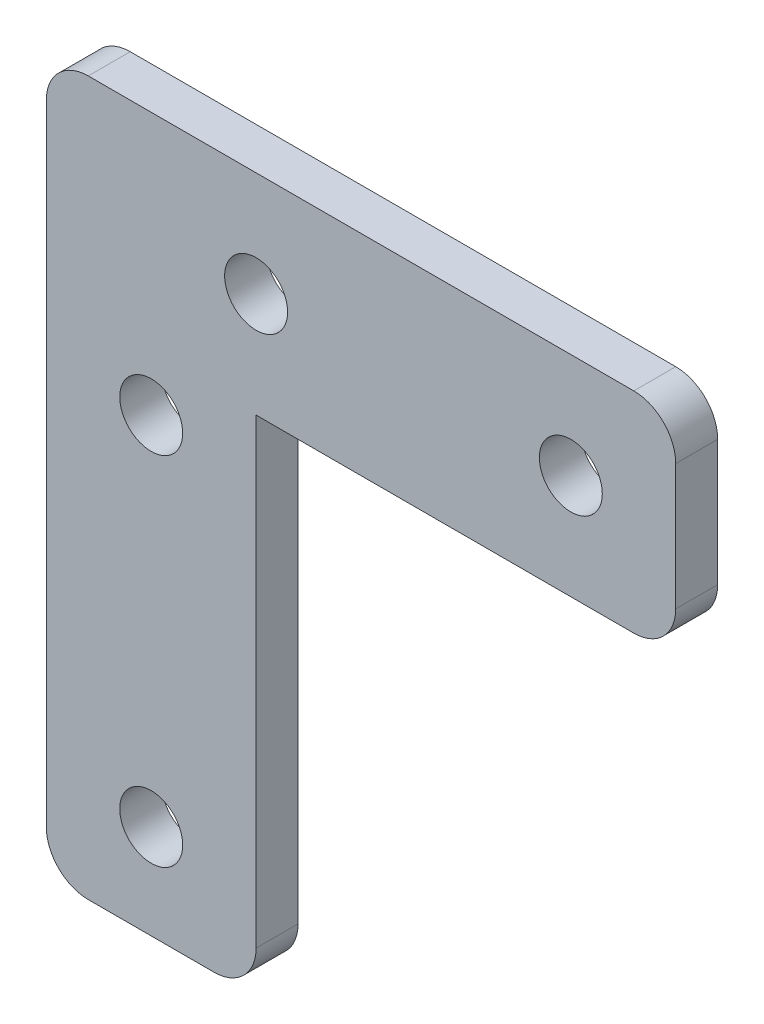
ISO-10303-21;
HEADER;
FILE_DESCRIPTION(('STEP AP214'),'2;1');
FILE_NAME('part.step','',(''),(''),'','','');
FILE_SCHEMA(('AUTOMOTIVE_DESIGN { 1 0 10303 214 1 1 1 1 }'));
ENDSEC;
DATA;
#1=APPLICATION_CONTEXT('core data for automotive mechanical design processes');
#2=APPLICATION_PROTOCOL_DEFINITION('international standard','automotive_design',2000,#1);
#3=PRODUCT_CONTEXT('',#1,'mechanical');
#4=PRODUCT('Part','Part','',(#3));
#5=PRODUCT_RELATED_PRODUCT_CATEGORY('part','',(#4));
#6=PRODUCT_DEFINITION_FORMATION('','',#4);
#7=PRODUCT_DEFINITION_CONTEXT('part definition',#1,'design');
#8=PRODUCT_DEFINITION('design','',#6,#7);
#9=PRODUCT_DEFINITION_SHAPE('','',#8);
#10=(LENGTH_UNIT() NAMED_UNIT(*) SI_UNIT(.MILLI.,.METRE.));
#11=(NAMED_UNIT(*) PLANE_ANGLE_UNIT() SI_UNIT($,.RADIAN.));
#12=(NAMED_UNIT(*) SI_UNIT($,.STERADIAN.) SOLID_ANGLE_UNIT());
#13=UNCERTAINTY_MEASURE_WITH_UNIT(LENGTH_MEASURE(1.E-05),#10,'distance_accuracy_value','');
#14=(GEOMETRIC_REPRESENTATION_CONTEXT(3) GLOBAL_UNCERTAINTY_ASSIGNED_CONTEXT((#13)) GLOBAL_UNIT_ASSIGNED_CONTEXT((#10,
#11,#12)) REPRESENTATION_CONTEXT('',''));
#15=CARTESIAN_POINT('',(0.,0.,0.));
#16=DIRECTION('',(0.,0.,1.));
#17=DIRECTION('',(1.,0.,0.));
#18=AXIS2_PLACEMENT_3D('',#15,#16,#17);
#19=CARTESIAN_POINT('',(0.,0.,2.));
#20=DIRECTION('',(0.,0.,1.));
#21=DIRECTION('',(1.,0.,0.));
#22=AXIS2_PLACEMENT_3D('',#19,#20,#21);
#23=PLANE('',#22);
#24=CARTESIAN_POINT('',(5.00000000000001,17.,2.));
#25=DIRECTION('',(0.,0.,1.));
#26=DIRECTION('',(1.,0.,0.));
#27=AXIS2_PLACEMENT_3D('',#24,#25,#26);
#28=CIRCLE('',#27,1.5);
#29=CARTESIAN_POINT('',(6.50000000000001,17.,2.));
#30=VERTEX_POINT('',#29);
#31=EDGE_CURVE('E266',#30,#30,#28,.T.);
#32=ORIENTED_EDGE('',*,*,#31,.F.);
#33=EDGE_LOOP('',(#32));
#34=FACE_BOUND('',#33,.T.);
#35=CARTESIAN_POINT('',(0.,9.49999999999999,2.));
#36=DIRECTION('',(0.,0.,1.));
#37=DIRECTION('',(1.,0.,0.));
#38=AXIS2_PLACEMENT_3D('',#35,#36,#37);
#39=CIRCLE('',#38,1.5);
#40=CARTESIAN_POINT('',(1.5,9.49999999999999,2.));
#41=VERTEX_POINT('',#40);
#42=EDGE_CURVE('E245',#41,#41,#39,.T.);
#43=ORIENTED_EDGE('',*,*,#42,.F.);
#44=EDGE_LOOP('',(#43));
#45=FACE_BOUND('',#44,.T.);
#46=DIRECTION('',(1.,0.,0.));
#47=VECTOR('',#46,1.);
#48=CARTESIAN_POINT('',(5.00000000000001,12.,2.));
#49=LINE('',#48,#47);
#50=CARTESIAN_POINT('',(5.00000000000001,12.,2.));
#51=VERTEX_POINT('',#50);
#52=CARTESIAN_POINT('',(23.,12.,2.));
#53=VERTEX_POINT('',#52);
#54=EDGE_CURVE('E126',#51,#53,#49,.T.);
#55=ORIENTED_EDGE('',*,*,#54,.T.);
#56=CARTESIAN_POINT('',(23.,14.,2.));
#57=DIRECTION('',(0.,0.,1.));
#58=DIRECTION('',(1.,0.,0.));
#59=AXIS2_PLACEMENT_3D('',#56,#57,#58);
#60=CIRCLE('',#59,2.);
#61=CARTESIAN_POINT('',(25.,14.,2.));
#62=VERTEX_POINT('',#61);
#63=EDGE_CURVE('E194',#53,#62,#60,.T.);
#64=ORIENTED_EDGE('',*,*,#63,.T.);
#65=DIRECTION('',(0.,1.,0.));
#66=VECTOR('',#65,1.);
#67=CARTESIAN_POINT('',(25.,12.,2.));
#68=LINE('',#67,#66);
#69=CARTESIAN_POINT('',(25.,20.,2.));
#70=VERTEX_POINT('',#69);
#71=EDGE_CURVE('E145',#62,#70,#68,.T.);
#72=ORIENTED_EDGE('',*,*,#71,.T.);
#73=CARTESIAN_POINT('',(23.,20.,2.));
#74=DIRECTION('',(0.,0.,1.));
#75=DIRECTION('',(1.,0.,0.));
#76=AXIS2_PLACEMENT_3D('',#73,#74,#75);
#77=CIRCLE('',#76,2.);
#78=CARTESIAN_POINT('',(23.,22.,2.));
#79=VERTEX_POINT('',#78);
#80=EDGE_CURVE('E184',#70,#79,#77,.T.);
#81=ORIENTED_EDGE('',*,*,#80,.T.);
#82=DIRECTION('',(-1.,0.,0.));
#83=VECTOR('',#82,1.);
#84=CARTESIAN_POINT('',(25.,22.,2.));
#85=LINE('',#84,#83);
#86=CARTESIAN_POINT('',(-2.99999999999999,22.,2.));
#87=VERTEX_POINT('',#86);
#88=EDGE_CURVE('E223',#79,#87,#85,.T.);
#89=ORIENTED_EDGE('',*,*,#88,.T.);
#90=CARTESIAN_POINT('',(-2.99999999999999,20.,2.));
#91=DIRECTION('',(0.,0.,1.));
#92=DIRECTION('',(1.,0.,0.));
#93=AXIS2_PLACEMENT_3D('',#90,#91,#92);
#94=CIRCLE('',#93,2.);
#95=CARTESIAN_POINT('',(-4.99999999999999,20.,2.));
#96=VERTEX_POINT('',#95);
#97=EDGE_CURVE('E187',#87,#96,#94,.T.);
#98=ORIENTED_EDGE('',*,*,#97,.T.);
#99=DIRECTION('',(0.,-1.,0.));
#100=VECTOR('',#99,1.);
#101=CARTESIAN_POINT('',(-4.99999999999999,22.,2.));
#102=LINE('',#101,#100);
#103=CARTESIAN_POINT('',(-4.99999999999999,-10.,2.));
#104=VERTEX_POINT('',#103);
#105=EDGE_CURVE('E159',#96,#104,#102,.T.);
#106=ORIENTED_EDGE('',*,*,#105,.T.);
#107=CARTESIAN_POINT('',(-3.00000000000001,-10.,2.));
#108=DIRECTION('',(0.,0.,1.));
#109=DIRECTION('',(1.,0.,0.));
#110=AXIS2_PLACEMENT_3D('',#107,#108,#109);
#111=CIRCLE('',#110,2.);
#112=CARTESIAN_POINT('',(-3.00000000000001,-12.,2.));
#113=VERTEX_POINT('',#112);
#114=EDGE_CURVE('E62',#104,#113,#111,.T.);
#115=ORIENTED_EDGE('',*,*,#114,.T.);
#116=DIRECTION('',(1.,0.,0.));
#117=VECTOR('',#116,1.);
#118=CARTESIAN_POINT('',(-5.00000000000001,-12.,2.));
#119=LINE('',#118,#117);
#120=CARTESIAN_POINT('',(3.00000000000001,-12.,2.));
#121=VERTEX_POINT('',#120);
#122=EDGE_CURVE('E153',#113,#121,#119,.T.);
#123=ORIENTED_EDGE('',*,*,#122,.T.);
#124=CARTESIAN_POINT('',(3.00000000000001,-10.,2.));
#125=DIRECTION('',(0.,0.,1.));
#126=DIRECTION('',(1.,0.,0.));
#127=AXIS2_PLACEMENT_3D('',#124,#125,#126);
#128=CIRCLE('',#127,2.);
#129=CARTESIAN_POINT('',(5.00000000000001,-10.,2.));
#130=VERTEX_POINT('',#129);
#131=EDGE_CURVE('E129',#121,#130,#128,.T.);
#132=ORIENTED_EDGE('',*,*,#131,.T.);
#133=DIRECTION('',(0.,1.,0.));
#134=VECTOR('',#133,1.);
#135=CARTESIAN_POINT('',(5.00000000000001,12.,2.));
#136=LINE('',#135,#134);
#137=EDGE_CURVE('E123',#130,#51,#136,.T.);
#138=ORIENTED_EDGE('',*,*,#137,.T.);
#139=EDGE_LOOP('',(#55,#64,#72,#81,#89,#98,#106,#115,#123,#132,#138));
#140=FACE_BOUND('',#139,.T.);
#141=CARTESIAN_POINT('',(0.,-7.50000000000001,2.));
#142=DIRECTION('',(0.,0.,1.));
#143=DIRECTION('',(1.,0.,0.));
#144=AXIS2_PLACEMENT_3D('',#141,#142,#143);
#145=CIRCLE('',#144,1.5);
#146=CARTESIAN_POINT('',(1.5,-7.50000000000001,2.));
#147=VERTEX_POINT('',#146);
#148=EDGE_CURVE('E258',#147,#147,#145,.T.);
#149=ORIENTED_EDGE('',*,*,#148,.F.);
#150=EDGE_LOOP('',(#149));
#151=FACE_BOUND('',#150,.T.);
#152=CARTESIAN_POINT('',(20.,17.,2.));
#153=DIRECTION('',(0.,0.,1.));
#154=DIRECTION('',(1.,0.,0.));
#155=AXIS2_PLACEMENT_3D('',#152,#153,#154);
#156=CIRCLE('',#155,1.5);
#157=CARTESIAN_POINT('',(21.5,17.,2.));
#158=VERTEX_POINT('',#157);
#159=EDGE_CURVE('E274',#158,#158,#156,.T.);
#160=ORIENTED_EDGE('',*,*,#159,.F.);
#161=EDGE_LOOP('',(#160));
#162=FACE_BOUND('',#161,.T.);
#163=ADVANCED_FACE('F39',(#34,#45,#140,#151,#162),#23,.T.);
#164=CARTESIAN_POINT('',(0.,0.,0.));
#165=DIRECTION('',(0.,0.,1.));
#166=DIRECTION('',(1.,0.,0.));
#167=AXIS2_PLACEMENT_3D('',#164,#165,#166);
#168=PLANE('',#167);
#169=DIRECTION('',(0.,1.,0.));
#170=VECTOR('',#169,1.);
#171=CARTESIAN_POINT('',(25.,12.,0.));
#172=LINE('',#171,#170);
#173=CARTESIAN_POINT('',(25.,14.,0.));
#174=VERTEX_POINT('',#173);
#175=CARTESIAN_POINT('',(25.,20.,0.));
#176=VERTEX_POINT('',#175);
#177=EDGE_CURVE('E234',#174,#176,#172,.T.);
#178=ORIENTED_EDGE('',*,*,#177,.F.);
#179=CARTESIAN_POINT('',(23.,14.,0.));
#180=DIRECTION('',(0.,0.,1.));
#181=DIRECTION('',(1.,0.,0.));
#182=AXIS2_PLACEMENT_3D('',#179,#180,#181);
#183=CIRCLE('',#182,2.);
#184=CARTESIAN_POINT('',(23.,12.,0.));
#185=VERTEX_POINT('',#184);
#186=EDGE_CURVE('E179',#174,#185,#183,.F.);
#187=ORIENTED_EDGE('',*,*,#186,.T.);
#188=DIRECTION('',(1.,0.,0.));
#189=VECTOR('',#188,1.);
#190=CARTESIAN_POINT('',(5.00000000000001,12.,0.));
#191=LINE('',#190,#189);
#192=CARTESIAN_POINT('',(5.00000000000001,12.,0.));
#193=VERTEX_POINT('',#192);
#194=EDGE_CURVE('E239',#193,#185,#191,.T.);
#195=ORIENTED_EDGE('',*,*,#194,.F.);
#196=DIRECTION('',(0.,1.,0.));
#197=VECTOR('',#196,1.);
#198=CARTESIAN_POINT('',(5.00000000000001,12.,0.));
#199=LINE('',#198,#197);
#200=CARTESIAN_POINT('',(5.00000000000001,-10.,0.));
#201=VERTEX_POINT('',#200);
#202=EDGE_CURVE('E149',#201,#193,#199,.T.);
#203=ORIENTED_EDGE('',*,*,#202,.F.);
#204=CARTESIAN_POINT('',(3.00000000000001,-10.,0.));
#205=DIRECTION('',(0.,0.,1.));
#206=DIRECTION('',(1.,0.,0.));
#207=AXIS2_PLACEMENT_3D('',#204,#205,#206);
#208=CIRCLE('',#207,2.);
#209=CARTESIAN_POINT('',(3.00000000000001,-12.,0.));
#210=VERTEX_POINT('',#209);
#211=EDGE_CURVE('E176',#201,#210,#208,.F.);
#212=ORIENTED_EDGE('',*,*,#211,.T.);
#213=DIRECTION('',(1.,0.,0.));
#214=VECTOR('',#213,1.);
#215=CARTESIAN_POINT('',(-5.00000000000001,-12.,0.));
#216=LINE('',#215,#214);
#217=CARTESIAN_POINT('',(-3.00000000000001,-12.,0.));
#218=VERTEX_POINT('',#217);
#219=EDGE_CURVE('E135',#218,#210,#216,.T.);
#220=ORIENTED_EDGE('',*,*,#219,.F.);
#221=CARTESIAN_POINT('',(-3.00000000000001,-10.,0.));
#222=DIRECTION('',(0.,0.,1.));
#223=DIRECTION('',(1.,0.,0.));
#224=AXIS2_PLACEMENT_3D('',#221,#222,#223);
#225=CIRCLE('',#224,2.);
#226=CARTESIAN_POINT('',(-5.00000000000001,-10.,0.));
#227=VERTEX_POINT('',#226);
#228=EDGE_CURVE('E173',#218,#227,#225,.F.);
#229=ORIENTED_EDGE('',*,*,#228,.T.);
#230=DIRECTION('',(0.,-1.,0.));
#231=VECTOR('',#230,1.);
#232=CARTESIAN_POINT('',(-4.99999999999999,12.,0.));
#233=LINE('',#232,#231);
#234=CARTESIAN_POINT('',(-4.99999999999999,20.,0.));
#235=VERTEX_POINT('',#234);
#236=EDGE_CURVE('E233',#235,#227,#233,.T.);
#237=ORIENTED_EDGE('',*,*,#236,.F.);
#238=CARTESIAN_POINT('',(-2.99999999999999,20.,0.));
#239=DIRECTION('',(0.,0.,1.));
#240=DIRECTION('',(1.,0.,0.));
#241=AXIS2_PLACEMENT_3D('',#238,#239,#240);
#242=CIRCLE('',#241,2.);
#243=CARTESIAN_POINT('',(-2.99999999999999,22.,0.));
#244=VERTEX_POINT('',#243);
#245=EDGE_CURVE('E170',#235,#244,#242,.F.);
#246=ORIENTED_EDGE('',*,*,#245,.T.);
#247=DIRECTION('',(-1.,0.,0.));
#248=VECTOR('',#247,1.);
#249=CARTESIAN_POINT('',(25.,22.,0.));
#250=LINE('',#249,#248);
#251=CARTESIAN_POINT('',(23.,22.,0.));
#252=VERTEX_POINT('',#251);
#253=EDGE_CURVE('E220',#252,#244,#250,.T.);
#254=ORIENTED_EDGE('',*,*,#253,.F.);
#255=CARTESIAN_POINT('',(23.,20.,0.));
#256=DIRECTION('',(0.,0.,1.));
#257=DIRECTION('',(1.,0.,0.));
#258=AXIS2_PLACEMENT_3D('',#255,#256,#257);
#259=CIRCLE('',#258,2.);
#260=EDGE_CURVE('E167',#252,#176,#259,.F.);
#261=ORIENTED_EDGE('',*,*,#260,.T.);
#262=EDGE_LOOP('',(#178,#187,#195,#203,#212,#220,#229,#237,#246,#254,#261));
#263=FACE_BOUND('',#262,.T.);
#264=CARTESIAN_POINT('',(0.,9.49999999999999,0.));
#265=DIRECTION('',(0.,0.,1.));
#266=DIRECTION('',(1.,0.,0.));
#267=AXIS2_PLACEMENT_3D('',#264,#265,#266);
#268=CIRCLE('',#267,1.5);
#269=CARTESIAN_POINT('',(1.5,9.49999999999999,0.));
#270=VERTEX_POINT('',#269);
#271=EDGE_CURVE('E254',#270,#270,#268,.T.);
#272=ORIENTED_EDGE('',*,*,#271,.T.);
#273=EDGE_LOOP('',(#272));
#274=FACE_BOUND('',#273,.T.);
#275=CARTESIAN_POINT('',(0.,-7.50000000000001,0.));
#276=DIRECTION('',(0.,0.,1.));
#277=DIRECTION('',(1.,0.,0.));
#278=AXIS2_PLACEMENT_3D('',#275,#276,#277);
#279=CIRCLE('',#278,1.5);
#280=CARTESIAN_POINT('',(1.5,-7.50000000000001,0.));
#281=VERTEX_POINT('',#280);
#282=EDGE_CURVE('E262',#281,#281,#279,.T.);
#283=ORIENTED_EDGE('',*,*,#282,.T.);
#284=EDGE_LOOP('',(#283));
#285=FACE_BOUND('',#284,.T.);
#286=CARTESIAN_POINT('',(5.00000000000001,17.,0.));
#287=DIRECTION('',(0.,0.,1.));
#288=DIRECTION('',(1.,0.,0.));
#289=AXIS2_PLACEMENT_3D('',#286,#287,#288);
#290=CIRCLE('',#289,1.5);
#291=CARTESIAN_POINT('',(6.50000000000001,17.,0.));
#292=VERTEX_POINT('',#291);
#293=EDGE_CURVE('E270',#292,#292,#290,.T.);
#294=ORIENTED_EDGE('',*,*,#293,.T.);
#295=EDGE_LOOP('',(#294));
#296=FACE_BOUND('',#295,.T.);
#297=CARTESIAN_POINT('',(20.,17.,0.));
#298=DIRECTION('',(0.,0.,1.));
#299=DIRECTION('',(1.,0.,0.));
#300=AXIS2_PLACEMENT_3D('',#297,#298,#299);
#301=CIRCLE('',#300,1.5);
#302=CARTESIAN_POINT('',(21.5,17.,0.));
#303=VERTEX_POINT('',#302);
#304=EDGE_CURVE('E278',#303,#303,#301,.T.);
#305=ORIENTED_EDGE('',*,*,#304,.T.);
#306=EDGE_LOOP('',(#305));
#307=FACE_BOUND('',#306,.T.);
#308=ADVANCED_FACE('F228',(#263,#274,#285,#296,#307),#168,.F.);
#309=CARTESIAN_POINT('',(5.00000000000001,12.,2.));
#310=DIRECTION('',(-1.,0.,0.));
#311=DIRECTION('',(0.,-1.,0.));
#312=AXIS2_PLACEMENT_3D('',#309,#310,#311);
#313=PLANE('',#312);
#314=ORIENTED_EDGE('',*,*,#137,.F.);
#315=DIRECTION('',(0.,0.,-1.));
#316=VECTOR('',#315,1.);
#317=CARTESIAN_POINT('',(5.00000000000001,-10.,2.));
#318=LINE('',#317,#316);
#319=EDGE_CURVE('E197',#130,#201,#318,.T.);
#320=ORIENTED_EDGE('',*,*,#319,.T.);
#321=ORIENTED_EDGE('',*,*,#202,.T.);
#322=DIRECTION('',(0.,0.,-1.));
#323=VECTOR('',#322,1.);
#324=CARTESIAN_POINT('',(5.00000000000001,12.,2.));
#325=LINE('',#324,#323);
#326=EDGE_CURVE('E141',#51,#193,#325,.T.);
#327=ORIENTED_EDGE('',*,*,#326,.F.);
#328=EDGE_LOOP('',(#314,#320,#321,#327));
#329=FACE_BOUND('',#328,.T.);
#330=ADVANCED_FACE('F147',(#329),#313,.F.);
#331=CARTESIAN_POINT('',(5.00000000000001,12.,2.));
#332=DIRECTION('',(0.,1.,0.));
#333=DIRECTION('',(0.,0.,1.));
#334=AXIS2_PLACEMENT_3D('',#331,#332,#333);
#335=PLANE('',#334);
#336=ORIENTED_EDGE('',*,*,#194,.T.);
#337=DIRECTION('',(0.,0.,-1.));
#338=VECTOR('',#337,1.);
#339=CARTESIAN_POINT('',(23.,12.,2.));
#340=LINE('',#339,#338);
#341=EDGE_CURVE('E143',#185,#53,#340,.F.);
#342=ORIENTED_EDGE('',*,*,#341,.T.);
#343=ORIENTED_EDGE('',*,*,#54,.F.);
#344=ORIENTED_EDGE('',*,*,#326,.T.);
#345=EDGE_LOOP('',(#336,#342,#343,#344));
#346=FACE_BOUND('',#345,.T.);
#347=ADVANCED_FACE('F140',(#346),#335,.F.);
#348=CARTESIAN_POINT('',(25.,12.,2.));
#349=DIRECTION('',(-1.,0.,0.));
#350=DIRECTION('',(0.,0.,1.));
#351=AXIS2_PLACEMENT_3D('',#348,#349,#350);
#352=PLANE('',#351);
#353=ORIENTED_EDGE('',*,*,#71,.F.);
#354=DIRECTION('',(0.,0.,-1.));
#355=VECTOR('',#354,1.);
#356=CARTESIAN_POINT('',(25.,14.,2.));
#357=LINE('',#356,#355);
#358=EDGE_CURVE('E157',#62,#174,#357,.T.);
#359=ORIENTED_EDGE('',*,*,#358,.T.);
#360=ORIENTED_EDGE('',*,*,#177,.T.);
#361=DIRECTION('',(0.,0.,-1.));
#362=VECTOR('',#361,1.);
#363=CARTESIAN_POINT('',(25.,20.,2.));
#364=LINE('',#363,#362);
#365=EDGE_CURVE('E152',#176,#70,#364,.F.);
#366=ORIENTED_EDGE('',*,*,#365,.T.);
#367=EDGE_LOOP('',(#353,#359,#360,#366));
#368=FACE_BOUND('',#367,.T.);
#369=ADVANCED_FACE('F311',(#368),#352,.F.);
#370=CARTESIAN_POINT('',(25.,22.,2.));
#371=DIRECTION('',(0.,-1.,0.));
#372=DIRECTION('',(0.,0.,-1.));
#373=AXIS2_PLACEMENT_3D('',#370,#371,#372);
#374=PLANE('',#373);
#375=ORIENTED_EDGE('',*,*,#253,.T.);
#376=DIRECTION('',(0.,0.,-1.));
#377=VECTOR('',#376,1.);
#378=CARTESIAN_POINT('',(-2.99999999999999,22.,2.));
#379=LINE('',#378,#377);
#380=EDGE_CURVE('E11',#244,#87,#379,.F.);
#381=ORIENTED_EDGE('',*,*,#380,.T.);
#382=ORIENTED_EDGE('',*,*,#88,.F.);
#383=DIRECTION('',(0.,0.,-1.));
#384=VECTOR('',#383,1.);
#385=CARTESIAN_POINT('',(23.,22.,2.));
#386=LINE('',#385,#384);
#387=EDGE_CURVE('E48',#79,#252,#386,.T.);
#388=ORIENTED_EDGE('',*,*,#387,.T.);
#389=EDGE_LOOP('',(#375,#381,#382,#388));
#390=FACE_BOUND('',#389,.T.);
#391=ADVANCED_FACE('F219',(#390),#374,.F.);
#392=CARTESIAN_POINT('',(-4.99999999999999,12.,2.));
#393=DIRECTION('',(1.,0.,0.));
#394=DIRECTION('',(0.,1.,0.));
#395=AXIS2_PLACEMENT_3D('',#392,#393,#394);
#396=PLANE('',#395);
#397=ORIENTED_EDGE('',*,*,#236,.T.);
#398=DIRECTION('',(0.,0.,-1.));
#399=VECTOR('',#398,1.);
#400=CARTESIAN_POINT('',(-5.00000000000001,-10.,2.));
#401=LINE('',#400,#399);
#402=EDGE_CURVE('E210',#227,#104,#401,.F.);
#403=ORIENTED_EDGE('',*,*,#402,.T.);
#404=ORIENTED_EDGE('',*,*,#105,.F.);
#405=DIRECTION('',(0.,0.,-1.));
#406=VECTOR('',#405,1.);
#407=CARTESIAN_POINT('',(-4.99999999999999,20.,2.));
#408=LINE('',#407,#406);
#409=EDGE_CURVE('E206',#96,#235,#408,.T.);
#410=ORIENTED_EDGE('',*,*,#409,.T.);
#411=EDGE_LOOP('',(#397,#403,#404,#410));
#412=FACE_BOUND('',#411,.T.);
#413=ADVANCED_FACE('F305',(#412),#396,.F.);
#414=CARTESIAN_POINT('',(-5.00000000000001,-12.,2.));
#415=DIRECTION('',(0.,1.,0.));
#416=DIRECTION('',(0.,0.,1.));
#417=AXIS2_PLACEMENT_3D('',#414,#415,#416);
#418=PLANE('',#417);
#419=ORIENTED_EDGE('',*,*,#219,.T.);
#420=DIRECTION('',(0.,0.,-1.));
#421=VECTOR('',#420,1.);
#422=CARTESIAN_POINT('',(3.00000000000001,-12.,2.));
#423=LINE('',#422,#421);
#424=EDGE_CURVE('E55',#210,#121,#423,.F.);
#425=ORIENTED_EDGE('',*,*,#424,.T.);
#426=ORIENTED_EDGE('',*,*,#122,.F.);
#427=DIRECTION('',(0.,0.,-1.));
#428=VECTOR('',#427,1.);
#429=CARTESIAN_POINT('',(-3.00000000000001,-12.,2.));
#430=LINE('',#429,#428);
#431=EDGE_CURVE('E200',#113,#218,#430,.T.);
#432=ORIENTED_EDGE('',*,*,#431,.T.);
#433=EDGE_LOOP('',(#419,#425,#426,#432));
#434=FACE_BOUND('',#433,.T.);
#435=ADVANCED_FACE('F302',(#434),#418,.F.);
#436=CARTESIAN_POINT('',(0.,9.49999999999999,2.));
#437=DIRECTION('',(0.,0.,-1.));
#438=DIRECTION('',(-1.,0.,0.));
#439=AXIS2_PLACEMENT_3D('',#436,#437,#438);
#440=CYLINDRICAL_SURFACE('',#439,1.5);
#441=ORIENTED_EDGE('',*,*,#42,.T.);
#442=EDGE_LOOP('',(#441));
#443=FACE_BOUND('',#442,.T.);
#444=ORIENTED_EDGE('',*,*,#271,.F.);
#445=EDGE_LOOP('',(#444));
#446=FACE_BOUND('',#445,.T.);
#447=ADVANCED_FACE('F299',(#443,#446),#440,.F.);
#448=CARTESIAN_POINT('',(0.,-7.50000000000001,2.));
#449=DIRECTION('',(0.,0.,-1.));
#450=DIRECTION('',(-1.,0.,0.));
#451=AXIS2_PLACEMENT_3D('',#448,#449,#450);
#452=CYLINDRICAL_SURFACE('',#451,1.5);
#453=ORIENTED_EDGE('',*,*,#148,.T.);
#454=EDGE_LOOP('',(#453));
#455=FACE_BOUND('',#454,.T.);
#456=ORIENTED_EDGE('',*,*,#282,.F.);
#457=EDGE_LOOP('',(#456));
#458=FACE_BOUND('',#457,.T.);
#459=ADVANCED_FACE('F437',(#455,#458),#452,.F.);
#460=CARTESIAN_POINT('',(5.00000000000001,17.,2.));
#461=DIRECTION('',(0.,0.,-1.));
#462=DIRECTION('',(-1.,0.,0.));
#463=AXIS2_PLACEMENT_3D('',#460,#461,#462);
#464=CYLINDRICAL_SURFACE('',#463,1.5);
#465=ORIENTED_EDGE('',*,*,#31,.T.);
#466=EDGE_LOOP('',(#465));
#467=FACE_BOUND('',#466,.T.);
#468=ORIENTED_EDGE('',*,*,#293,.F.);
#469=EDGE_LOOP('',(#468));
#470=FACE_BOUND('',#469,.T.);
#471=ADVANCED_FACE('F428',(#467,#470),#464,.F.);
#472=CARTESIAN_POINT('',(20.,17.,2.));
#473=DIRECTION('',(0.,0.,-1.));
#474=DIRECTION('',(-1.,0.,0.));
#475=AXIS2_PLACEMENT_3D('',#472,#473,#474);
#476=CYLINDRICAL_SURFACE('',#475,1.5);
#477=ORIENTED_EDGE('',*,*,#159,.T.);
#478=EDGE_LOOP('',(#477));
#479=FACE_BOUND('',#478,.T.);
#480=ORIENTED_EDGE('',*,*,#304,.F.);
#481=EDGE_LOOP('',(#480));
#482=FACE_BOUND('',#481,.T.);
#483=ADVANCED_FACE('F286',(#479,#482),#476,.F.);
#484=CARTESIAN_POINT('',(23.,14.,2.));
#485=DIRECTION('',(0.,0.,-1.));
#486=DIRECTION('',(-1.,0.,0.));
#487=AXIS2_PLACEMENT_3D('',#484,#485,#486);
#488=CYLINDRICAL_SURFACE('',#487,2.);
#489=ORIENTED_EDGE('',*,*,#63,.F.);
#490=ORIENTED_EDGE('',*,*,#341,.F.);
#491=ORIENTED_EDGE('',*,*,#186,.F.);
#492=ORIENTED_EDGE('',*,*,#358,.F.);
#493=EDGE_LOOP('',(#489,#490,#491,#492));
#494=FACE_BOUND('',#493,.T.);
#495=ADVANCED_FACE('F319',(#494),#488,.T.);
#496=CARTESIAN_POINT('',(3.00000000000001,-10.,2.));
#497=DIRECTION('',(0.,0.,-1.));
#498=DIRECTION('',(-1.,0.,0.));
#499=AXIS2_PLACEMENT_3D('',#496,#497,#498);
#500=CYLINDRICAL_SURFACE('',#499,2.);
#501=ORIENTED_EDGE('',*,*,#131,.F.);
#502=ORIENTED_EDGE('',*,*,#424,.F.);
#503=ORIENTED_EDGE('',*,*,#211,.F.);
#504=ORIENTED_EDGE('',*,*,#319,.F.);
#505=EDGE_LOOP('',(#501,#502,#503,#504));
#506=FACE_BOUND('',#505,.T.);
#507=ADVANCED_FACE('F322',(#506),#500,.T.);
#508=CARTESIAN_POINT('',(-3.00000000000001,-10.,2.));
#509=DIRECTION('',(0.,0.,-1.));
#510=DIRECTION('',(-1.,0.,0.));
#511=AXIS2_PLACEMENT_3D('',#508,#509,#510);
#512=CYLINDRICAL_SURFACE('',#511,2.);
#513=ORIENTED_EDGE('',*,*,#114,.F.);
#514=ORIENTED_EDGE('',*,*,#402,.F.);
#515=ORIENTED_EDGE('',*,*,#228,.F.);
#516=ORIENTED_EDGE('',*,*,#431,.F.);
#517=EDGE_LOOP('',(#513,#514,#515,#516));
#518=FACE_BOUND('',#517,.T.);
#519=ADVANCED_FACE('F326',(#518),#512,.T.);
#520=CARTESIAN_POINT('',(-2.99999999999999,20.,2.));
#521=DIRECTION('',(0.,0.,-1.));
#522=DIRECTION('',(-1.,0.,0.));
#523=AXIS2_PLACEMENT_3D('',#520,#521,#522);
#524=CYLINDRICAL_SURFACE('',#523,2.);
#525=ORIENTED_EDGE('',*,*,#97,.F.);
#526=ORIENTED_EDGE('',*,*,#380,.F.);
#527=ORIENTED_EDGE('',*,*,#245,.F.);
#528=ORIENTED_EDGE('',*,*,#409,.F.);
#529=EDGE_LOOP('',(#525,#526,#527,#528));
#530=FACE_BOUND('',#529,.T.);
#531=ADVANCED_FACE('F329',(#530),#524,.T.);
#532=CARTESIAN_POINT('',(23.,20.,2.));
#533=DIRECTION('',(0.,0.,-1.));
#534=DIRECTION('',(-1.,0.,0.));
#535=AXIS2_PLACEMENT_3D('',#532,#533,#534);
#536=CYLINDRICAL_SURFACE('',#535,2.);
#537=ORIENTED_EDGE('',*,*,#80,.F.);
#538=ORIENTED_EDGE('',*,*,#365,.F.);
#539=ORIENTED_EDGE('',*,*,#260,.F.);
#540=ORIENTED_EDGE('',*,*,#387,.F.);
#541=EDGE_LOOP('',(#537,#538,#539,#540));
#542=FACE_BOUND('',#541,.T.);
#543=ADVANCED_FACE('F41',(#542),#536,.T.);
#544=CLOSED_SHELL('',(#163,#308,#330,#347,#369,#391,#413,#435,#447,#459,#471,#483,#495,#507,
#519,#531,#543));
#545=MANIFOLD_SOLID_BREP('B2',#544);
#546=ADVANCED_BREP_SHAPE_REPRESENTATION('',(#18,#545),#14);
#547=SHAPE_DEFINITION_REPRESENTATION(#9,#546);
ENDSEC;
END-ISO-10303-21;
